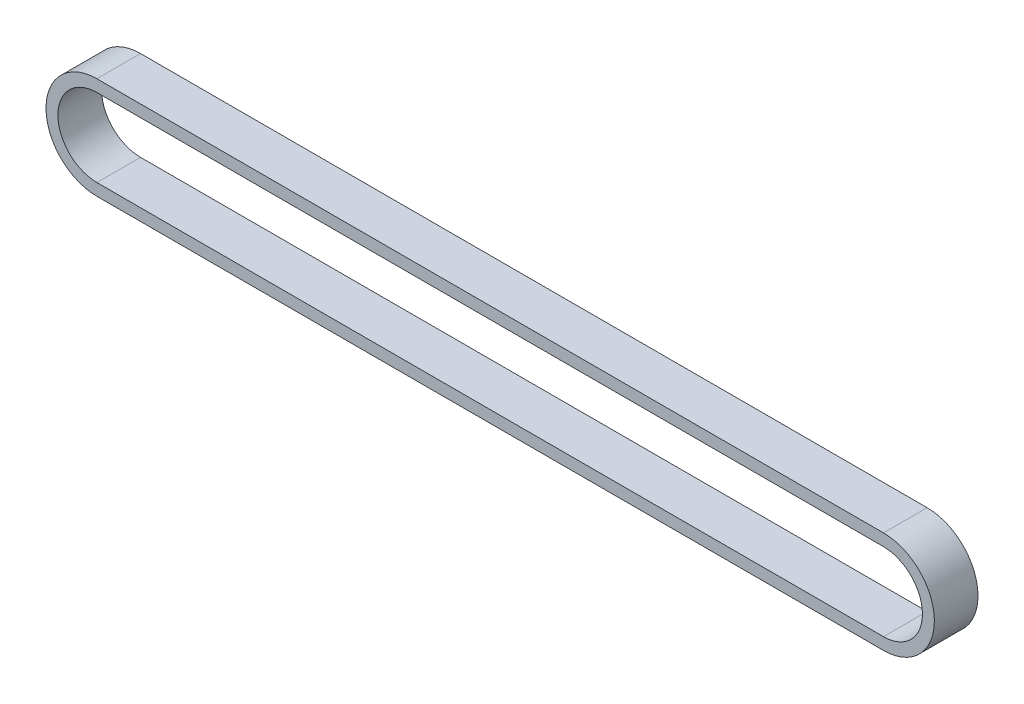
ISO-10303-21;
HEADER;
FILE_DESCRIPTION(('STEP AP214'),'2;1');
FILE_NAME('part.step','',(''),(''),'','','');
FILE_SCHEMA(('AUTOMOTIVE_DESIGN { 1 0 10303 214 1 1 1 1 }'));
ENDSEC;
DATA;
#1=APPLICATION_CONTEXT('core data for automotive mechanical design processes');
#2=APPLICATION_PROTOCOL_DEFINITION('international standard','automotive_design',2000,#1);
#3=PRODUCT_CONTEXT('',#1,'mechanical');
#4=PRODUCT('Part','Part','',(#3));
#5=PRODUCT_RELATED_PRODUCT_CATEGORY('part','',(#4));
#6=PRODUCT_DEFINITION_FORMATION('','',#4);
#7=PRODUCT_DEFINITION_CONTEXT('part definition',#1,'design');
#8=PRODUCT_DEFINITION('design','',#6,#7);
#9=PRODUCT_DEFINITION_SHAPE('','',#8);
#10=(LENGTH_UNIT() NAMED_UNIT(*) SI_UNIT(.MILLI.,.METRE.));
#11=(NAMED_UNIT(*) PLANE_ANGLE_UNIT() SI_UNIT($,.RADIAN.));
#12=(NAMED_UNIT(*) SI_UNIT($,.STERADIAN.) SOLID_ANGLE_UNIT());
#13=UNCERTAINTY_MEASURE_WITH_UNIT(LENGTH_MEASURE(1.E-05),#10,'distance_accuracy_value','');
#14=(GEOMETRIC_REPRESENTATION_CONTEXT(3) GLOBAL_UNCERTAINTY_ASSIGNED_CONTEXT((#13)) GLOBAL_UNIT_ASSIGNED_CONTEXT((#10,
#11,#12)) REPRESENTATION_CONTEXT('',''));
#15=CARTESIAN_POINT('',(0.,0.,0.));
#16=DIRECTION('',(0.,0.,1.));
#17=DIRECTION('',(1.,0.,0.));
#18=AXIS2_PLACEMENT_3D('',#15,#16,#17);
#19=CARTESIAN_POINT('',(0.,0.,3.));
#20=DIRECTION('',(0.,0.,1.));
#21=DIRECTION('',(1.,0.,0.));
#22=AXIS2_PLACEMENT_3D('',#19,#20,#21);
#23=PLANE('',#22);
#24=CARTESIAN_POINT('',(0.,0.,3.));
#25=DIRECTION('',(0.,0.,1.));
#26=DIRECTION('',(1.,0.,0.));
#27=AXIS2_PLACEMENT_3D('',#24,#25,#26);
#28=CIRCLE('',#27,7.);
#29=CARTESIAN_POINT('',(0.,7.,3.));
#30=VERTEX_POINT('',#29);
#31=CARTESIAN_POINT('',(0.,-7.,3.));
#32=VERTEX_POINT('',#31);
#33=EDGE_CURVE('E140',#30,#32,#28,.T.);
#34=ORIENTED_EDGE('',*,*,#33,.T.);
#35=DIRECTION('',(1.,0.,0.));
#36=VECTOR('',#35,1.);
#37=CARTESIAN_POINT('',(0.,-7.,3.));
#38=LINE('',#37,#36);
#39=CARTESIAN_POINT('',(108.161063376759,-7.,3.));
#40=VERTEX_POINT('',#39);
#41=EDGE_CURVE('E143',#32,#40,#38,.T.);
#42=ORIENTED_EDGE('',*,*,#41,.T.);
#43=CARTESIAN_POINT('',(108.161063376759,0.,3.));
#44=DIRECTION('',(0.,0.,1.));
#45=DIRECTION('',(1.,0.,0.));
#46=AXIS2_PLACEMENT_3D('',#43,#44,#45);
#47=CIRCLE('',#46,7.);
#48=CARTESIAN_POINT('',(108.161063376759,7.,3.));
#49=VERTEX_POINT('',#48);
#50=EDGE_CURVE('E146',#40,#49,#47,.T.);
#51=ORIENTED_EDGE('',*,*,#50,.T.);
#52=DIRECTION('',(-1.,0.,0.));
#53=VECTOR('',#52,1.);
#54=CARTESIAN_POINT('',(0.,7.,3.));
#55=LINE('',#54,#53);
#56=EDGE_CURVE('E148',#49,#30,#55,.T.);
#57=ORIENTED_EDGE('',*,*,#56,.T.);
#58=EDGE_LOOP('',(#34,#42,#51,#57));
#59=FACE_BOUND('',#58,.T.);
#60=DIRECTION('',(1.,0.,0.));
#61=VECTOR('',#60,1.);
#62=CARTESIAN_POINT('',(0.,-5.36,3.));
#63=LINE('',#62,#61);
#64=CARTESIAN_POINT('',(0.,-5.36,3.));
#65=VERTEX_POINT('',#64);
#66=CARTESIAN_POINT('',(108.161063376759,-5.36,3.));
#67=VERTEX_POINT('',#66);
#68=EDGE_CURVE('E112',#65,#67,#63,.T.);
#69=ORIENTED_EDGE('',*,*,#68,.F.);
#70=CARTESIAN_POINT('',(0.,0.,3.));
#71=DIRECTION('',(0.,0.,1.));
#72=DIRECTION('',(1.,0.,0.));
#73=AXIS2_PLACEMENT_3D('',#70,#71,#72);
#74=CIRCLE('',#73,5.36);
#75=CARTESIAN_POINT('',(0.,5.36,3.));
#76=VERTEX_POINT('',#75);
#77=EDGE_CURVE('E104',#76,#65,#74,.T.);
#78=ORIENTED_EDGE('',*,*,#77,.F.);
#79=DIRECTION('',(-1.,0.,0.));
#80=VECTOR('',#79,1.);
#81=CARTESIAN_POINT('',(0.,5.36,3.));
#82=LINE('',#81,#80);
#83=CARTESIAN_POINT('',(108.161063376759,5.36,3.));
#84=VERTEX_POINT('',#83);
#85=EDGE_CURVE('E126',#84,#76,#82,.T.);
#86=ORIENTED_EDGE('',*,*,#85,.F.);
#87=CARTESIAN_POINT('',(108.161063376759,0.,3.));
#88=DIRECTION('',(0.,0.,1.));
#89=DIRECTION('',(1.,0.,0.));
#90=AXIS2_PLACEMENT_3D('',#87,#88,#89);
#91=CIRCLE('',#90,5.36);
#92=EDGE_CURVE('E124',#67,#84,#91,.T.);
#93=ORIENTED_EDGE('',*,*,#92,.F.);
#94=EDGE_LOOP('',(#69,#78,#86,#93));
#95=FACE_BOUND('',#94,.T.);
#96=ADVANCED_FACE('F39',(#59,#95),#23,.T.);
#97=CARTESIAN_POINT('',(0.,0.,-3.));
#98=DIRECTION('',(0.,0.,1.));
#99=DIRECTION('',(1.,0.,0.));
#100=AXIS2_PLACEMENT_3D('',#97,#98,#99);
#101=PLANE('',#100);
#102=CARTESIAN_POINT('',(0.,0.,-3.));
#103=DIRECTION('',(0.,0.,1.));
#104=DIRECTION('',(1.,0.,0.));
#105=AXIS2_PLACEMENT_3D('',#102,#103,#104);
#106=CIRCLE('',#105,7.);
#107=CARTESIAN_POINT('',(0.,7.,-3.));
#108=VERTEX_POINT('',#107);
#109=CARTESIAN_POINT('',(0.,-7.,-3.));
#110=VERTEX_POINT('',#109);
#111=EDGE_CURVE('E120',#108,#110,#106,.T.);
#112=ORIENTED_EDGE('',*,*,#111,.F.);
#113=DIRECTION('',(-1.,0.,0.));
#114=VECTOR('',#113,1.);
#115=CARTESIAN_POINT('',(0.,7.,-3.));
#116=LINE('',#115,#114);
#117=CARTESIAN_POINT('',(108.161063376759,7.,-3.));
#118=VERTEX_POINT('',#117);
#119=EDGE_CURVE('E144',#118,#108,#116,.T.);
#120=ORIENTED_EDGE('',*,*,#119,.F.);
#121=CARTESIAN_POINT('',(108.161063376759,0.,-3.));
#122=DIRECTION('',(0.,0.,1.));
#123=DIRECTION('',(1.,0.,0.));
#124=AXIS2_PLACEMENT_3D('',#121,#122,#123);
#125=CIRCLE('',#124,7.);
#126=CARTESIAN_POINT('',(108.161063376759,-7.,-3.));
#127=VERTEX_POINT('',#126);
#128=EDGE_CURVE('E155',#127,#118,#125,.T.);
#129=ORIENTED_EDGE('',*,*,#128,.F.);
#130=DIRECTION('',(1.,0.,0.));
#131=VECTOR('',#130,1.);
#132=CARTESIAN_POINT('',(0.,-7.,-3.));
#133=LINE('',#132,#131);
#134=EDGE_CURVE('E153',#110,#127,#133,.T.);
#135=ORIENTED_EDGE('',*,*,#134,.F.);
#136=EDGE_LOOP('',(#112,#120,#129,#135));
#137=FACE_BOUND('',#136,.T.);
#138=CARTESIAN_POINT('',(0.,0.,-3.));
#139=DIRECTION('',(0.,0.,1.));
#140=DIRECTION('',(1.,0.,0.));
#141=AXIS2_PLACEMENT_3D('',#138,#139,#140);
#142=CIRCLE('',#141,5.36);
#143=CARTESIAN_POINT('',(0.,5.36,-3.));
#144=VERTEX_POINT('',#143);
#145=CARTESIAN_POINT('',(0.,-5.36,-3.));
#146=VERTEX_POINT('',#145);
#147=EDGE_CURVE('E62',#144,#146,#142,.T.);
#148=ORIENTED_EDGE('',*,*,#147,.T.);
#149=DIRECTION('',(1.,0.,0.));
#150=VECTOR('',#149,1.);
#151=CARTESIAN_POINT('',(0.,-5.36,-3.));
#152=LINE('',#151,#150);
#153=CARTESIAN_POINT('',(108.161063376759,-5.36,-3.));
#154=VERTEX_POINT('',#153);
#155=EDGE_CURVE('E119',#146,#154,#152,.T.);
#156=ORIENTED_EDGE('',*,*,#155,.T.);
#157=CARTESIAN_POINT('',(108.161063376759,0.,-3.));
#158=DIRECTION('',(0.,0.,1.));
#159=DIRECTION('',(1.,0.,0.));
#160=AXIS2_PLACEMENT_3D('',#157,#158,#159);
#161=CIRCLE('',#160,5.36);
#162=CARTESIAN_POINT('',(108.161063376759,5.36,-3.));
#163=VERTEX_POINT('',#162);
#164=EDGE_CURVE('E132',#154,#163,#161,.T.);
#165=ORIENTED_EDGE('',*,*,#164,.T.);
#166=DIRECTION('',(-1.,0.,0.));
#167=VECTOR('',#166,1.);
#168=CARTESIAN_POINT('',(0.,5.36,-3.));
#169=LINE('',#168,#167);
#170=EDGE_CURVE('E113',#163,#144,#169,.T.);
#171=ORIENTED_EDGE('',*,*,#170,.T.);
#172=EDGE_LOOP('',(#148,#156,#165,#171));
#173=FACE_BOUND('',#172,.T.);
#174=ADVANCED_FACE('F173',(#137,#173),#101,.F.);
#175=CARTESIAN_POINT('',(0.,0.,3.));
#176=DIRECTION('',(0.,0.,-1.));
#177=DIRECTION('',(-1.,0.,0.));
#178=AXIS2_PLACEMENT_3D('',#175,#176,#177);
#179=CYLINDRICAL_SURFACE('',#178,7.);
#180=ORIENTED_EDGE('',*,*,#111,.T.);
#181=DIRECTION('',(0.,0.,-1.));
#182=VECTOR('',#181,1.);
#183=CARTESIAN_POINT('',(0.,-7.,3.));
#184=LINE('',#183,#182);
#185=EDGE_CURVE('E11',#32,#110,#184,.T.);
#186=ORIENTED_EDGE('',*,*,#185,.F.);
#187=ORIENTED_EDGE('',*,*,#33,.F.);
#188=DIRECTION('',(0.,0.,-1.));
#189=VECTOR('',#188,1.);
#190=CARTESIAN_POINT('',(0.,7.,3.));
#191=LINE('',#190,#189);
#192=EDGE_CURVE('E150',#30,#108,#191,.T.);
#193=ORIENTED_EDGE('',*,*,#192,.T.);
#194=EDGE_LOOP('',(#180,#186,#187,#193));
#195=FACE_BOUND('',#194,.T.);
#196=ADVANCED_FACE('F41',(#195),#179,.T.);
#197=CARTESIAN_POINT('',(0.,-7.,3.));
#198=DIRECTION('',(0.,1.,0.));
#199=DIRECTION('',(0.,0.,1.));
#200=AXIS2_PLACEMENT_3D('',#197,#198,#199);
#201=PLANE('',#200);
#202=ORIENTED_EDGE('',*,*,#134,.T.);
#203=DIRECTION('',(0.,0.,-1.));
#204=VECTOR('',#203,1.);
#205=CARTESIAN_POINT('',(108.161063376759,-7.,3.));
#206=LINE('',#205,#204);
#207=EDGE_CURVE('E47',#40,#127,#206,.T.);
#208=ORIENTED_EDGE('',*,*,#207,.F.);
#209=ORIENTED_EDGE('',*,*,#41,.F.);
#210=ORIENTED_EDGE('',*,*,#185,.T.);
#211=EDGE_LOOP('',(#202,#208,#209,#210));
#212=FACE_BOUND('',#211,.T.);
#213=ADVANCED_FACE('F183',(#212),#201,.F.);
#214=CARTESIAN_POINT('',(108.161063376759,0.,3.));
#215=DIRECTION('',(0.,0.,-1.));
#216=DIRECTION('',(-1.,0.,0.));
#217=AXIS2_PLACEMENT_3D('',#214,#215,#216);
#218=CYLINDRICAL_SURFACE('',#217,7.);
#219=ORIENTED_EDGE('',*,*,#128,.T.);
#220=DIRECTION('',(0.,0.,-1.));
#221=VECTOR('',#220,1.);
#222=CARTESIAN_POINT('',(108.161063376759,7.,3.));
#223=LINE('',#222,#221);
#224=EDGE_CURVE('E160',#49,#118,#223,.T.);
#225=ORIENTED_EDGE('',*,*,#224,.F.);
#226=ORIENTED_EDGE('',*,*,#50,.F.);
#227=ORIENTED_EDGE('',*,*,#207,.T.);
#228=EDGE_LOOP('',(#219,#225,#226,#227));
#229=FACE_BOUND('',#228,.T.);
#230=ADVANCED_FACE('F167',(#229),#218,.T.);
#231=CARTESIAN_POINT('',(0.,7.,3.));
#232=DIRECTION('',(0.,-1.,0.));
#233=DIRECTION('',(0.,0.,-1.));
#234=AXIS2_PLACEMENT_3D('',#231,#232,#233);
#235=PLANE('',#234);
#236=ORIENTED_EDGE('',*,*,#119,.T.);
#237=ORIENTED_EDGE('',*,*,#192,.F.);
#238=ORIENTED_EDGE('',*,*,#56,.F.);
#239=ORIENTED_EDGE('',*,*,#224,.T.);
#240=EDGE_LOOP('',(#236,#237,#238,#239));
#241=FACE_BOUND('',#240,.T.);
#242=ADVANCED_FACE('F177',(#241),#235,.F.);
#243=CARTESIAN_POINT('',(0.,0.,3.));
#244=DIRECTION('',(0.,0.,-1.));
#245=DIRECTION('',(-1.,0.,0.));
#246=AXIS2_PLACEMENT_3D('',#243,#244,#245);
#247=CYLINDRICAL_SURFACE('',#246,5.36);
#248=ORIENTED_EDGE('',*,*,#147,.F.);
#249=DIRECTION('',(0.,0.,-1.));
#250=VECTOR('',#249,1.);
#251=CARTESIAN_POINT('',(0.,5.36,3.));
#252=LINE('',#251,#250);
#253=EDGE_CURVE('E108',#76,#144,#252,.T.);
#254=ORIENTED_EDGE('',*,*,#253,.F.);
#255=ORIENTED_EDGE('',*,*,#77,.T.);
#256=DIRECTION('',(0.,0.,-1.));
#257=VECTOR('',#256,1.);
#258=CARTESIAN_POINT('',(0.,-5.36,3.));
#259=LINE('',#258,#257);
#260=EDGE_CURVE('E107',#65,#146,#259,.T.);
#261=ORIENTED_EDGE('',*,*,#260,.T.);
#262=EDGE_LOOP('',(#248,#254,#255,#261));
#263=FACE_BOUND('',#262,.T.);
#264=ADVANCED_FACE('F106',(#263),#247,.F.);
#265=CARTESIAN_POINT('',(0.,-5.36,3.));
#266=DIRECTION('',(0.,1.,0.));
#267=DIRECTION('',(0.,0.,1.));
#268=AXIS2_PLACEMENT_3D('',#265,#266,#267);
#269=PLANE('',#268);
#270=ORIENTED_EDGE('',*,*,#155,.F.);
#271=ORIENTED_EDGE('',*,*,#260,.F.);
#272=ORIENTED_EDGE('',*,*,#68,.T.);
#273=DIRECTION('',(0.,0.,-1.));
#274=VECTOR('',#273,1.);
#275=CARTESIAN_POINT('',(108.161063376759,-5.36,3.));
#276=LINE('',#275,#274);
#277=EDGE_CURVE('E121',#67,#154,#276,.T.);
#278=ORIENTED_EDGE('',*,*,#277,.T.);
#279=EDGE_LOOP('',(#270,#271,#272,#278));
#280=FACE_BOUND('',#279,.T.);
#281=ADVANCED_FACE('F116',(#280),#269,.T.);
#282=CARTESIAN_POINT('',(108.161063376759,0.,3.));
#283=DIRECTION('',(0.,0.,-1.));
#284=DIRECTION('',(-1.,0.,0.));
#285=AXIS2_PLACEMENT_3D('',#282,#283,#284);
#286=CYLINDRICAL_SURFACE('',#285,5.36);
#287=ORIENTED_EDGE('',*,*,#164,.F.);
#288=ORIENTED_EDGE('',*,*,#277,.F.);
#289=ORIENTED_EDGE('',*,*,#92,.T.);
#290=DIRECTION('',(0.,0.,-1.));
#291=VECTOR('',#290,1.);
#292=CARTESIAN_POINT('',(108.161063376759,5.36,3.));
#293=LINE('',#292,#291);
#294=EDGE_CURVE('E54',#84,#163,#293,.T.);
#295=ORIENTED_EDGE('',*,*,#294,.T.);
#296=EDGE_LOOP('',(#287,#288,#289,#295));
#297=FACE_BOUND('',#296,.T.);
#298=ADVANCED_FACE('F206',(#297),#286,.F.);
#299=CARTESIAN_POINT('',(0.,5.36,3.));
#300=DIRECTION('',(0.,-1.,0.));
#301=DIRECTION('',(0.,0.,-1.));
#302=AXIS2_PLACEMENT_3D('',#299,#300,#301);
#303=PLANE('',#302);
#304=ORIENTED_EDGE('',*,*,#170,.F.);
#305=ORIENTED_EDGE('',*,*,#294,.F.);
#306=ORIENTED_EDGE('',*,*,#85,.T.);
#307=ORIENTED_EDGE('',*,*,#253,.T.);
#308=EDGE_LOOP('',(#304,#305,#306,#307));
#309=FACE_BOUND('',#308,.T.);
#310=ADVANCED_FACE('F210',(#309),#303,.T.);
#311=CLOSED_SHELL('',(#96,#174,#196,#213,#230,#242,#264,#281,#298,#310));
#312=MANIFOLD_SOLID_BREP('B2',#311);
#313=ADVANCED_BREP_SHAPE_REPRESENTATION('',(#18,#312),#14);
#314=SHAPE_DEFINITION_REPRESENTATION(#9,#313);
ENDSEC;
END-ISO-10303-21;
